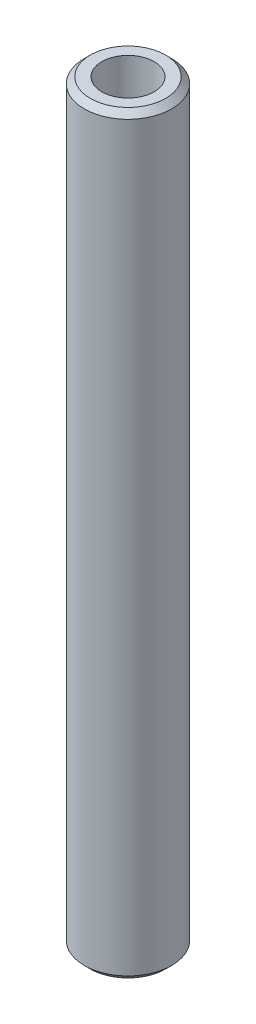
ISO-10303-21;
HEADER;
FILE_DESCRIPTION(('STEP AP214'),'2;1');
FILE_NAME('part.step','',(''),(''),'','','');
FILE_SCHEMA(('AUTOMOTIVE_DESIGN { 1 0 10303 214 1 1 1 1 }'));
ENDSEC;
DATA;
#1=APPLICATION_CONTEXT('core data for automotive mechanical design processes');
#2=APPLICATION_PROTOCOL_DEFINITION('international standard','automotive_design',2000,#1);
#3=PRODUCT_CONTEXT('',#1,'mechanical');
#4=PRODUCT('Part','Part','',(#3));
#5=PRODUCT_RELATED_PRODUCT_CATEGORY('part','',(#4));
#6=PRODUCT_DEFINITION_FORMATION('','',#4);
#7=PRODUCT_DEFINITION_CONTEXT('part definition',#1,'design');
#8=PRODUCT_DEFINITION('design','',#6,#7);
#9=PRODUCT_DEFINITION_SHAPE('','',#8);
#10=(LENGTH_UNIT() NAMED_UNIT(*) SI_UNIT(.MILLI.,.METRE.));
#11=(NAMED_UNIT(*) PLANE_ANGLE_UNIT() SI_UNIT($,.RADIAN.));
#12=(NAMED_UNIT(*) SI_UNIT($,.STERADIAN.) SOLID_ANGLE_UNIT());
#13=UNCERTAINTY_MEASURE_WITH_UNIT(LENGTH_MEASURE(1.E-05),#10,'distance_accuracy_value','');
#14=(GEOMETRIC_REPRESENTATION_CONTEXT(3) GLOBAL_UNCERTAINTY_ASSIGNED_CONTEXT((#13)) GLOBAL_UNIT_ASSIGNED_CONTEXT((#10,
#11,#12)) REPRESENTATION_CONTEXT('',''));
#15=CARTESIAN_POINT('',(0.,0.,0.));
#16=DIRECTION('',(0.,0.,1.));
#17=DIRECTION('',(1.,0.,0.));
#18=AXIS2_PLACEMENT_3D('',#15,#16,#17);
#19=CARTESIAN_POINT('',(0.,517.986169419383,0.));
#20=DIRECTION('',(0.,-1.,0.));
#21=DIRECTION('',(0.,0.,-1.));
#22=AXIS2_PLACEMENT_3D('',#19,#20,#21);
#23=CYLINDRICAL_SURFACE('',#22,30.);
#24=CARTESIAN_POINT('',(0.,513.836275099814,0.));
#25=DIRECTION('',(0.,1.,0.));
#26=DIRECTION('',(0.,0.,1.));
#27=AXIS2_PLACEMENT_3D('',#24,#25,#26);
#28=CIRCLE('',#27,30.);
#29=CARTESIAN_POINT('',(0.,513.836275099814,30.));
#30=VERTEX_POINT('',#29);
#31=EDGE_CURVE('E50',#30,#30,#28,.F.);
#32=ORIENTED_EDGE('',*,*,#31,.T.);
#33=EDGE_LOOP('',(#32));
#34=FACE_BOUND('',#33,.T.);
#35=CARTESIAN_POINT('',(0.,4.14989431956869,0.));
#36=DIRECTION('',(0.,1.,0.));
#37=DIRECTION('',(0.,0.,1.));
#38=AXIS2_PLACEMENT_3D('',#35,#36,#37);
#39=CIRCLE('',#38,30.);
#40=CARTESIAN_POINT('',(0.,4.14989431956869,30.));
#41=VERTEX_POINT('',#40);
#42=EDGE_CURVE('E51',#41,#41,#39,.T.);
#43=ORIENTED_EDGE('',*,*,#42,.T.);
#44=EDGE_LOOP('',(#43));
#45=FACE_BOUND('',#44,.T.);
#46=ADVANCED_FACE('F39',(#34,#45),#23,.T.);
#47=CARTESIAN_POINT('',(0.,517.986169419383,0.));
#48=DIRECTION('',(0.,1.,0.));
#49=DIRECTION('',(0.,0.,1.));
#50=AXIS2_PLACEMENT_3D('',#47,#48,#49);
#51=PLANE('',#50);
#52=CARTESIAN_POINT('',(0.,517.986169419383,0.));
#53=DIRECTION('',(0.,1.,0.));
#54=DIRECTION('',(0.,0.,1.));
#55=AXIS2_PLACEMENT_3D('',#52,#53,#54);
#56=CIRCLE('',#55,25.8501056804312);
#57=CARTESIAN_POINT('',(0.,517.986169419383,25.8501056804312));
#58=VERTEX_POINT('',#57);
#59=EDGE_CURVE('E54',#58,#58,#56,.T.);
#60=ORIENTED_EDGE('',*,*,#59,.T.);
#61=EDGE_LOOP('',(#60));
#62=FACE_BOUND('',#61,.T.);
#63=CARTESIAN_POINT('',(0.,517.986169419383,0.));
#64=DIRECTION('',(0.,1.,0.));
#65=DIRECTION('',(0.,0.,1.));
#66=AXIS2_PLACEMENT_3D('',#63,#64,#65);
#67=CIRCLE('',#66,17.9821470129403);
#68=CARTESIAN_POINT('',(0.,517.986169419383,17.9821470129403));
#69=VERTEX_POINT('',#68);
#70=EDGE_CURVE('E58',#69,#69,#67,.T.);
#71=ORIENTED_EDGE('',*,*,#70,.F.);
#72=EDGE_LOOP('',(#71));
#73=FACE_BOUND('',#72,.T.);
#74=ADVANCED_FACE('F69',(#62,#73),#51,.T.);
#75=CARTESIAN_POINT('',(0.,0.,0.));
#76=DIRECTION('',(0.,1.,0.));
#77=DIRECTION('',(0.,0.,1.));
#78=AXIS2_PLACEMENT_3D('',#75,#76,#77);
#79=PLANE('',#78);
#80=CARTESIAN_POINT('',(0.,0.,0.));
#81=DIRECTION('',(0.,1.,0.));
#82=DIRECTION('',(0.,0.,1.));
#83=AXIS2_PLACEMENT_3D('',#80,#81,#82);
#84=CIRCLE('',#83,25.8501056804313);
#85=CARTESIAN_POINT('',(0.,0.,25.8501056804313));
#86=VERTEX_POINT('',#85);
#87=EDGE_CURVE('E10',#86,#86,#84,.F.);
#88=ORIENTED_EDGE('',*,*,#87,.T.);
#89=EDGE_LOOP('',(#88));
#90=FACE_BOUND('',#89,.T.);
#91=CARTESIAN_POINT('',(0.,0.,0.));
#92=DIRECTION('',(0.,1.,0.));
#93=DIRECTION('',(0.,0.,1.));
#94=AXIS2_PLACEMENT_3D('',#91,#92,#93);
#95=CIRCLE('',#94,17.9821470129403);
#96=CARTESIAN_POINT('',(0.,0.,17.9821470129403));
#97=VERTEX_POINT('',#96);
#98=EDGE_CURVE('E63',#97,#97,#95,.T.);
#99=ORIENTED_EDGE('',*,*,#98,.T.);
#100=EDGE_LOOP('',(#99));
#101=FACE_BOUND('',#100,.T.);
#102=ADVANCED_FACE('F75',(#90,#101),#79,.F.);
#103=CARTESIAN_POINT('',(0.,517.986169419383,0.));
#104=DIRECTION('',(0.,-1.,0.));
#105=DIRECTION('',(0.,0.,-1.));
#106=AXIS2_PLACEMENT_3D('',#103,#104,#105);
#107=CYLINDRICAL_SURFACE('',#106,17.9821470129403);
#108=ORIENTED_EDGE('',*,*,#70,.T.);
#109=EDGE_LOOP('',(#108));
#110=FACE_BOUND('',#109,.T.);
#111=ORIENTED_EDGE('',*,*,#98,.F.);
#112=EDGE_LOOP('',(#111));
#113=FACE_BOUND('',#112,.T.);
#114=ADVANCED_FACE('F70',(#110,#113),#107,.F.);
#115=CARTESIAN_POINT('',(0.,517.986169419383,0.));
#116=DIRECTION('',(0.,-1.,0.));
#117=DIRECTION('',(0.,0.,-1.));
#118=AXIS2_PLACEMENT_3D('',#115,#116,#117);
#119=CONICAL_SURFACE('',#118,25.8501056804312,0.785398163397425);
#120=ORIENTED_EDGE('',*,*,#31,.F.);
#121=EDGE_LOOP('',(#120));
#122=FACE_BOUND('',#121,.T.);
#123=ORIENTED_EDGE('',*,*,#59,.F.);
#124=EDGE_LOOP('',(#123));
#125=FACE_BOUND('',#124,.T.);
#126=ADVANCED_FACE('F81',(#122,#125),#119,.T.);
#127=CARTESIAN_POINT('',(0.,4.14989431956869,0.));
#128=DIRECTION('',(0.,1.,0.));
#129=DIRECTION('',(0.,0.,1.));
#130=AXIS2_PLACEMENT_3D('',#127,#128,#129);
#131=CONICAL_SURFACE('',#130,30.,0.785398163397445);
#132=ORIENTED_EDGE('',*,*,#87,.F.);
#133=EDGE_LOOP('',(#132));
#134=FACE_BOUND('',#133,.T.);
#135=ORIENTED_EDGE('',*,*,#42,.F.);
#136=EDGE_LOOP('',(#135));
#137=FACE_BOUND('',#136,.T.);
#138=ADVANCED_FACE('F45',(#134,#137),#131,.T.);
#139=CLOSED_SHELL('',(#46,#74,#102,#114,#126,#138));
#140=MANIFOLD_SOLID_BREP('B2',#139);
#141=ADVANCED_BREP_SHAPE_REPRESENTATION('',(#18,#140),#14);
#142=SHAPE_DEFINITION_REPRESENTATION(#9,#141);
ENDSEC;
END-ISO-10303-21;
